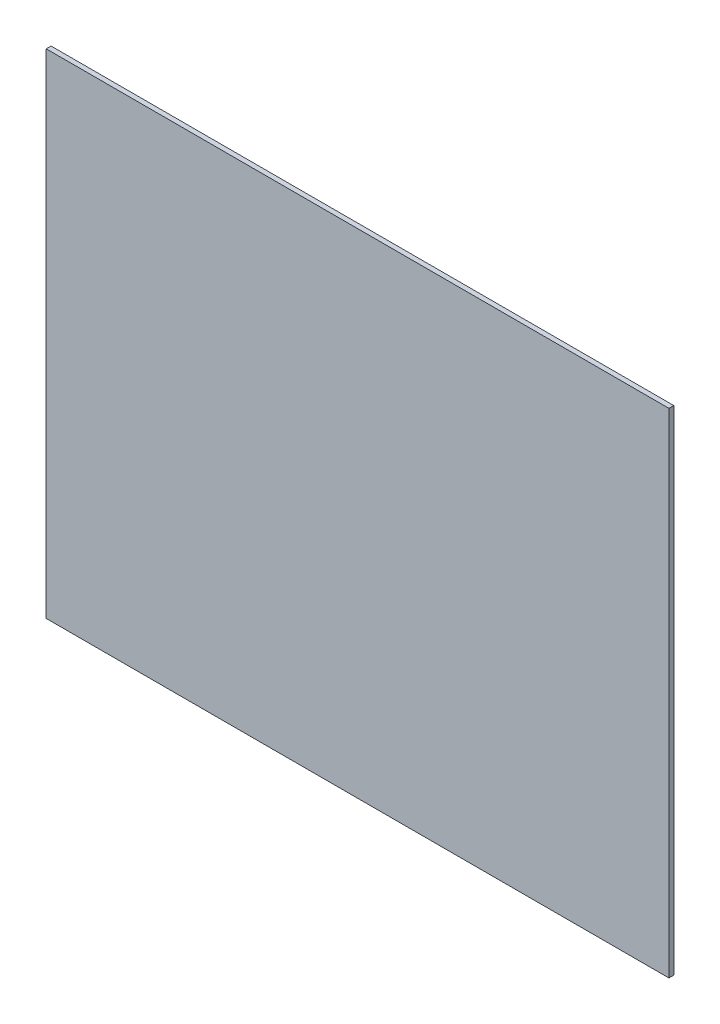
ISO-10303-21;
HEADER;
FILE_DESCRIPTION(('STEP AP214'),'2;1');
FILE_NAME('part.step','',(''),(''),'','','');
FILE_SCHEMA(('AUTOMOTIVE_DESIGN { 1 0 10303 214 1 1 1 1 }'));
ENDSEC;
DATA;
#1=APPLICATION_CONTEXT('core data for automotive mechanical design processes');
#2=APPLICATION_PROTOCOL_DEFINITION('international standard','automotive_design',2000,#1);
#3=PRODUCT_CONTEXT('',#1,'mechanical');
#4=PRODUCT('Part','Part','',(#3));
#5=PRODUCT_RELATED_PRODUCT_CATEGORY('part','',(#4));
#6=PRODUCT_DEFINITION_FORMATION('','',#4);
#7=PRODUCT_DEFINITION_CONTEXT('part definition',#1,'design');
#8=PRODUCT_DEFINITION('design','',#6,#7);
#9=PRODUCT_DEFINITION_SHAPE('','',#8);
#10=(LENGTH_UNIT() NAMED_UNIT(*) SI_UNIT(.MILLI.,.METRE.));
#11=(NAMED_UNIT(*) PLANE_ANGLE_UNIT() SI_UNIT($,.RADIAN.));
#12=(NAMED_UNIT(*) SI_UNIT($,.STERADIAN.) SOLID_ANGLE_UNIT());
#13=UNCERTAINTY_MEASURE_WITH_UNIT(LENGTH_MEASURE(1.E-05),#10,'distance_accuracy_value','');
#14=(GEOMETRIC_REPRESENTATION_CONTEXT(3) GLOBAL_UNCERTAINTY_ASSIGNED_CONTEXT((#13)) GLOBAL_UNIT_ASSIGNED_CONTEXT((#10,
#11,#12)) REPRESENTATION_CONTEXT('',''));
#15=CARTESIAN_POINT('',(0.,0.,0.));
#16=DIRECTION('',(0.,0.,1.));
#17=DIRECTION('',(1.,0.,0.));
#18=AXIS2_PLACEMENT_3D('',#15,#16,#17);
#19=CARTESIAN_POINT('',(0.,0.,3.));
#20=DIRECTION('',(1.,0.,0.));
#21=DIRECTION('',(0.,0.,-1.));
#22=AXIS2_PLACEMENT_3D('',#19,#20,#21);
#23=PLANE('',#22);
#24=DIRECTION('',(0.,-1.,0.));
#25=VECTOR('',#24,1.);
#26=CARTESIAN_POINT('',(0.,0.,0.));
#27=LINE('',#26,#25);
#28=CARTESIAN_POINT('',(0.,305.,0.));
#29=VERTEX_POINT('',#28);
#30=CARTESIAN_POINT('',(0.,0.,0.));
#31=VERTEX_POINT('',#30);
#32=EDGE_CURVE('E97',#29,#31,#27,.T.);
#33=ORIENTED_EDGE('',*,*,#32,.T.);
#34=DIRECTION('',(0.,0.,-1.));
#35=VECTOR('',#34,1.);
#36=CARTESIAN_POINT('',(0.,0.,3.));
#37=LINE('',#36,#35);
#38=CARTESIAN_POINT('',(0.,0.,3.));
#39=VERTEX_POINT('',#38);
#40=EDGE_CURVE('E11',#39,#31,#37,.T.);
#41=ORIENTED_EDGE('',*,*,#40,.F.);
#42=DIRECTION('',(0.,-1.,0.));
#43=VECTOR('',#42,1.);
#44=CARTESIAN_POINT('',(0.,0.,3.));
#45=LINE('',#44,#43);
#46=CARTESIAN_POINT('',(0.,305.,3.));
#47=VERTEX_POINT('',#46);
#48=EDGE_CURVE('E85',#47,#39,#45,.T.);
#49=ORIENTED_EDGE('',*,*,#48,.F.);
#50=DIRECTION('',(0.,0.,-1.));
#51=VECTOR('',#50,1.);
#52=CARTESIAN_POINT('',(0.,305.,3.));
#53=LINE('',#52,#51);
#54=EDGE_CURVE('E93',#47,#29,#53,.T.);
#55=ORIENTED_EDGE('',*,*,#54,.T.);
#56=EDGE_LOOP('',(#33,#41,#49,#55));
#57=FACE_BOUND('',#56,.T.);
#58=ADVANCED_FACE('F34',(#57),#23,.F.);
#59=CARTESIAN_POINT('',(0.,0.,3.));
#60=DIRECTION('',(0.,1.,0.));
#61=DIRECTION('',(0.,0.,1.));
#62=AXIS2_PLACEMENT_3D('',#59,#60,#61);
#63=PLANE('',#62);
#64=DIRECTION('',(1.,0.,0.));
#65=VECTOR('',#64,1.);
#66=CARTESIAN_POINT('',(0.,0.,0.));
#67=LINE('',#66,#65);
#68=CARTESIAN_POINT('',(385.,0.,0.));
#69=VERTEX_POINT('',#68);
#70=EDGE_CURVE('E89',#31,#69,#67,.T.);
#71=ORIENTED_EDGE('',*,*,#70,.T.);
#72=DIRECTION('',(0.,0.,-1.));
#73=VECTOR('',#72,1.);
#74=CARTESIAN_POINT('',(385.,0.,3.));
#75=LINE('',#74,#73);
#76=CARTESIAN_POINT('',(385.,0.,3.));
#77=VERTEX_POINT('',#76);
#78=EDGE_CURVE('E42',#77,#69,#75,.T.);
#79=ORIENTED_EDGE('',*,*,#78,.F.);
#80=DIRECTION('',(1.,0.,0.));
#81=VECTOR('',#80,1.);
#82=CARTESIAN_POINT('',(0.,0.,3.));
#83=LINE('',#82,#81);
#84=EDGE_CURVE('E80',#39,#77,#83,.T.);
#85=ORIENTED_EDGE('',*,*,#84,.F.);
#86=ORIENTED_EDGE('',*,*,#40,.T.);
#87=EDGE_LOOP('',(#71,#79,#85,#86));
#88=FACE_BOUND('',#87,.T.);
#89=ADVANCED_FACE('F88',(#88),#63,.F.);
#90=CARTESIAN_POINT('',(385.,0.,3.));
#91=DIRECTION('',(-1.,0.,0.));
#92=DIRECTION('',(0.,0.,1.));
#93=AXIS2_PLACEMENT_3D('',#90,#91,#92);
#94=PLANE('',#93);
#95=DIRECTION('',(0.,1.,0.));
#96=VECTOR('',#95,1.);
#97=CARTESIAN_POINT('',(385.,0.,0.));
#98=LINE('',#97,#96);
#99=CARTESIAN_POINT('',(385.,305.,0.));
#100=VERTEX_POINT('',#99);
#101=EDGE_CURVE('E67',#69,#100,#98,.T.);
#102=ORIENTED_EDGE('',*,*,#101,.T.);
#103=DIRECTION('',(0.,0.,-1.));
#104=VECTOR('',#103,1.);
#105=CARTESIAN_POINT('',(385.,305.,3.));
#106=LINE('',#105,#104);
#107=CARTESIAN_POINT('',(385.,305.,3.));
#108=VERTEX_POINT('',#107);
#109=EDGE_CURVE('E90',#108,#100,#106,.T.);
#110=ORIENTED_EDGE('',*,*,#109,.F.);
#111=DIRECTION('',(0.,1.,0.));
#112=VECTOR('',#111,1.);
#113=CARTESIAN_POINT('',(385.,0.,3.));
#114=LINE('',#113,#112);
#115=EDGE_CURVE('E83',#77,#108,#114,.T.);
#116=ORIENTED_EDGE('',*,*,#115,.F.);
#117=ORIENTED_EDGE('',*,*,#78,.T.);
#118=EDGE_LOOP('',(#102,#110,#116,#117));
#119=FACE_BOUND('',#118,.T.);
#120=ADVANCED_FACE('F91',(#119),#94,.F.);
#121=CARTESIAN_POINT('',(0.,305.,3.));
#122=DIRECTION('',(0.,-1.,0.));
#123=DIRECTION('',(0.,0.,-1.));
#124=AXIS2_PLACEMENT_3D('',#121,#122,#123);
#125=PLANE('',#124);
#126=DIRECTION('',(-1.,0.,0.));
#127=VECTOR('',#126,1.);
#128=CARTESIAN_POINT('',(0.,305.,0.));
#129=LINE('',#128,#127);
#130=EDGE_CURVE('E73',#100,#29,#129,.T.);
#131=ORIENTED_EDGE('',*,*,#130,.T.);
#132=ORIENTED_EDGE('',*,*,#54,.F.);
#133=DIRECTION('',(-1.,0.,0.));
#134=VECTOR('',#133,1.);
#135=CARTESIAN_POINT('',(0.,305.,3.));
#136=LINE('',#135,#134);
#137=EDGE_CURVE('E50',#108,#47,#136,.T.);
#138=ORIENTED_EDGE('',*,*,#137,.F.);
#139=ORIENTED_EDGE('',*,*,#109,.T.);
#140=EDGE_LOOP('',(#131,#132,#138,#139));
#141=FACE_BOUND('',#140,.T.);
#142=ADVANCED_FACE('F104',(#141),#125,.F.);
#143=CARTESIAN_POINT('',(0.,0.,3.));
#144=DIRECTION('',(0.,0.,-1.));
#145=DIRECTION('',(-1.,0.,0.));
#146=AXIS2_PLACEMENT_3D('',#143,#144,#145);
#147=PLANE('',#146);
#148=ORIENTED_EDGE('',*,*,#48,.T.);
#149=ORIENTED_EDGE('',*,*,#84,.T.);
#150=ORIENTED_EDGE('',*,*,#115,.T.);
#151=ORIENTED_EDGE('',*,*,#137,.T.);
#152=EDGE_LOOP('',(#148,#149,#150,#151));
#153=FACE_BOUND('',#152,.T.);
#154=ADVANCED_FACE('F81',(#153),#147,.F.);
#155=CARTESIAN_POINT('',(0.,0.,0.));
#156=DIRECTION('',(0.,0.,-1.));
#157=DIRECTION('',(-1.,0.,0.));
#158=AXIS2_PLACEMENT_3D('',#155,#156,#157);
#159=PLANE('',#158);
#160=ORIENTED_EDGE('',*,*,#32,.F.);
#161=ORIENTED_EDGE('',*,*,#130,.F.);
#162=ORIENTED_EDGE('',*,*,#101,.F.);
#163=ORIENTED_EDGE('',*,*,#70,.F.);
#164=EDGE_LOOP('',(#160,#161,#162,#163));
#165=FACE_BOUND('',#164,.T.);
#166=ADVANCED_FACE('F107',(#165),#159,.T.);
#167=CLOSED_SHELL('',(#58,#89,#120,#142,#154,#166));
#168=MANIFOLD_SOLID_BREP('B2',#167);
#169=ADVANCED_BREP_SHAPE_REPRESENTATION('',(#18,#168),#14);
#170=SHAPE_DEFINITION_REPRESENTATION(#9,#169);
ENDSEC;
END-ISO-10303-21;
